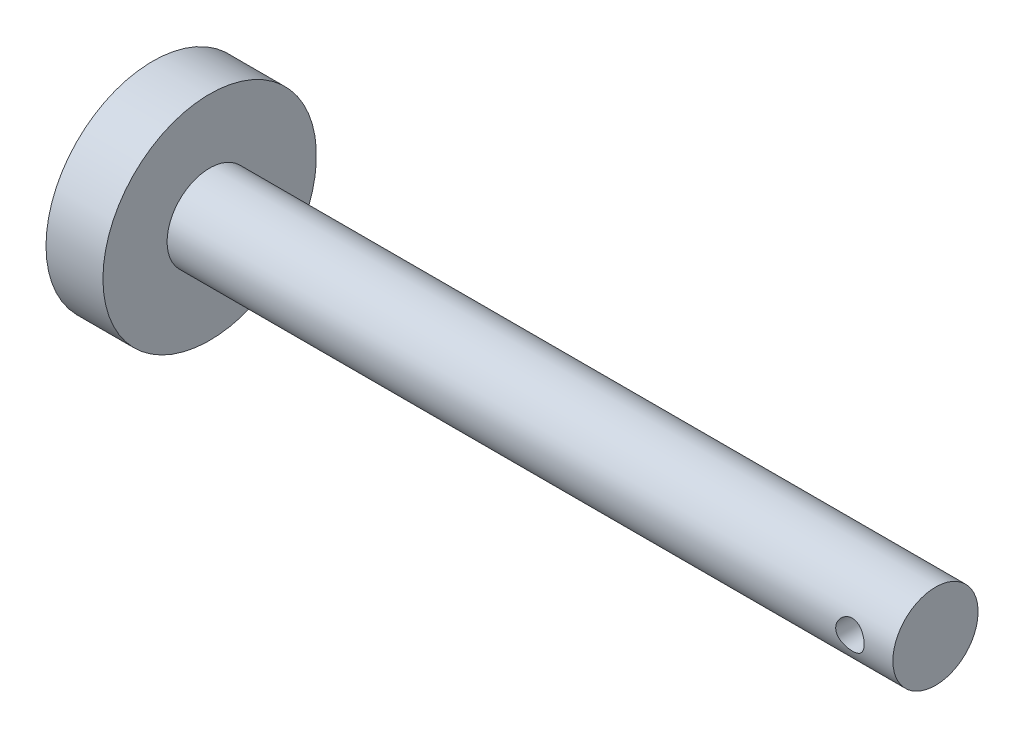
ISO-10303-21;
HEADER;
FILE_DESCRIPTION(('STEP AP214'),'2;1');
FILE_NAME('part.step','',(''),(''),'','','');
FILE_SCHEMA(('AUTOMOTIVE_DESIGN { 1 0 10303 214 1 1 1 1 }'));
ENDSEC;
DATA;
#1=APPLICATION_CONTEXT('core data for automotive mechanical design processes');
#2=APPLICATION_PROTOCOL_DEFINITION('international standard','automotive_design',2000,#1);
#3=PRODUCT_CONTEXT('',#1,'mechanical');
#4=PRODUCT('Part','Part','',(#3));
#5=PRODUCT_RELATED_PRODUCT_CATEGORY('part','',(#4));
#6=PRODUCT_DEFINITION_FORMATION('','',#4);
#7=PRODUCT_DEFINITION_CONTEXT('part definition',#1,'design');
#8=PRODUCT_DEFINITION('design','',#6,#7);
#9=PRODUCT_DEFINITION_SHAPE('','',#8);
#10=(LENGTH_UNIT() NAMED_UNIT(*) SI_UNIT(.MILLI.,.METRE.));
#11=(NAMED_UNIT(*) PLANE_ANGLE_UNIT() SI_UNIT($,.RADIAN.));
#12=(NAMED_UNIT(*) SI_UNIT($,.STERADIAN.) SOLID_ANGLE_UNIT());
#13=UNCERTAINTY_MEASURE_WITH_UNIT(LENGTH_MEASURE(1.E-05),#10,'distance_accuracy_value','');
#14=(GEOMETRIC_REPRESENTATION_CONTEXT(3) GLOBAL_UNCERTAINTY_ASSIGNED_CONTEXT((#13)) GLOBAL_UNIT_ASSIGNED_CONTEXT((#10,
#11,#12)) REPRESENTATION_CONTEXT('',''));
#15=CARTESIAN_POINT('',(0.,0.,0.));
#16=DIRECTION('',(0.,0.,1.));
#17=DIRECTION('',(1.,0.,0.));
#18=AXIS2_PLACEMENT_3D('',#15,#16,#17);
#19=CARTESIAN_POINT('',(-16.06719227637,7.5,0.));
#20=DIRECTION('',(1.,0.,0.));
#21=DIRECTION('',(0.,0.,-1.));
#22=AXIS2_PLACEMENT_3D('',#19,#20,#21);
#23=PLANE('',#22);
#24=CARTESIAN_POINT('',(-16.06719227637,0.,0.));
#25=DIRECTION('',(-1.,0.,0.));
#26=DIRECTION('',(0.,0.,1.));
#27=AXIS2_PLACEMENT_3D('',#24,#25,#26);
#28=CIRCLE('',#27,7.5);
#29=CARTESIAN_POINT('',(-16.06719227637,0.,7.5));
#30=VERTEX_POINT('',#29);
#31=EDGE_CURVE('E95',#30,#30,#28,.T.);
#32=ORIENTED_EDGE('',*,*,#31,.T.);
#33=EDGE_LOOP('',(#32));
#34=FACE_BOUND('',#33,.T.);
#35=ADVANCED_FACE('F37',(#34),#23,.F.);
#36=CARTESIAN_POINT('',(38.93280772363,0.,0.));
#37=DIRECTION('',(-1.,0.,0.));
#38=DIRECTION('',(0.,0.,1.));
#39=AXIS2_PLACEMENT_3D('',#36,#37,#38);
#40=PLANE('',#39);
#41=CARTESIAN_POINT('',(38.93280772363,0.,0.));
#42=DIRECTION('',(-1.,0.,0.));
#43=DIRECTION('',(0.,0.,1.));
#44=AXIS2_PLACEMENT_3D('',#41,#42,#43);
#45=CIRCLE('',#44,2.99222797927462);
#46=CARTESIAN_POINT('',(38.93280772363,0.,2.99222797927462));
#47=VERTEX_POINT('',#46);
#48=EDGE_CURVE('E10',#47,#47,#45,.T.);
#49=ORIENTED_EDGE('',*,*,#48,.F.);
#50=EDGE_LOOP('',(#49));
#51=FACE_BOUND('',#50,.T.);
#52=ADVANCED_FACE('F83',(#51),#40,.F.);
#53=CARTESIAN_POINT('',(-16.06719227637,0.,0.));
#54=DIRECTION('',(-1.,0.,0.));
#55=DIRECTION('',(0.,0.,1.));
#56=AXIS2_PLACEMENT_3D('',#53,#54,#55);
#57=CYLINDRICAL_SURFACE('',#56,2.99222797927462);
#58=CARTESIAN_POINT('',(36.9118895102414,0.,2.99222797927462));
#59=CARTESIAN_POINT('',(36.9118897922976,-0.0545553253540949,2.99222815282481));
#60=CARTESIAN_POINT('',(36.9074105730416,-0.109108891827844,2.99072223037483));
#61=CARTESIAN_POINT('',(36.8896672231851,-0.216608687992767,2.98486319522237));
#62=CARTESIAN_POINT('',(36.8764022257693,-0.269554758547358,2.9805098015855));
#63=CARTESIAN_POINT('',(36.8415931344329,-0.372274239578402,2.96942874053509));
#64=CARTESIAN_POINT('',(36.8200629233711,-0.422052807852353,2.96270505597474));
#65=CARTESIAN_POINT('',(36.7693974722776,-0.517292326825729,2.94756937414283));
#66=CARTESIAN_POINT('',(36.7402607198645,-0.562752416443161,2.93915704120028));
#67=CARTESIAN_POINT('',(36.6741447482866,-0.649646175439101,2.92120171610127));
#68=CARTESIAN_POINT('',(36.6369482371645,-0.690908860879529,2.91163153890286));
#69=CARTESIAN_POINT('',(36.5562306004885,-0.766741351328753,2.89258838974004));
#70=CARTESIAN_POINT('',(36.5127080761975,-0.801309672201839,2.88311543977066));
#71=CARTESIAN_POINT('',(36.4190319345908,-0.863750369743544,2.86503984738372));
#72=CARTESIAN_POINT('',(36.3687229051216,-0.891400099725266,2.85647031150325));
#73=CARTESIAN_POINT('',(36.2638362080172,-0.937773146111818,2.84158535325049));
#74=CARTESIAN_POINT('',(36.2092598567621,-0.956499202737065,2.83526923906284));
#75=CARTESIAN_POINT('',(36.099332546151,-0.983851233319363,2.82589260335001));
#76=CARTESIAN_POINT('',(36.0440703819927,-0.99279771718112,2.8227290919144));
#77=CARTESIAN_POINT('',(35.9327457559515,-1.00133859761036,2.81971129116668));
#78=CARTESIAN_POINT('',(35.8766835483164,-1.00093590192539,2.81985597295223));
#79=CARTESIAN_POINT('',(35.7680875809307,-0.991038635936562,2.82334798587778));
#80=CARTESIAN_POINT('',(35.7155100865583,-0.981962843021346,2.8265477950195));
#81=CARTESIAN_POINT('',(35.612671995397,-0.955660359448898,2.83554805825484));
#82=CARTESIAN_POINT('',(35.5624116781565,-0.938432688143691,2.84134882523195));
#83=CARTESIAN_POINT('',(35.4646851487417,-0.896042234125146,2.85500219226893));
#84=CARTESIAN_POINT('',(35.4172772385225,-0.870755678941096,2.86288644521403));
#85=CARTESIAN_POINT('',(35.3272453444493,-0.813051181448322,2.87980522122608));
#86=CARTESIAN_POINT('',(35.2846227535946,-0.780631170688277,2.88884007760685));
#87=CARTESIAN_POINT('',(35.2030188937312,-0.707570657994943,2.9076219339705));
#88=CARTESIAN_POINT('',(35.1643462468633,-0.666587953223343,2.9173814199205));
#89=CARTESIAN_POINT('',(35.0943418664469,-0.578598961384775,2.93609811511371));
#90=CARTESIAN_POINT('',(35.0630108442934,-0.531592091265331,2.9450552465578));
#91=CARTESIAN_POINT('',(35.0083288722668,-0.432231946625073,2.96127665436627));
#92=CARTESIAN_POINT('',(34.9850610058379,-0.379829832167567,2.96852307392317));
#93=CARTESIAN_POINT('',(34.947766481642,-0.27155507842802,2.9803768935242));
#94=CARTESIAN_POINT('',(34.9337365963177,-0.215683658722359,2.98498521519101));
#95=CARTESIAN_POINT('',(34.9158639668068,-0.104668687219116,2.99089074836865));
#96=CARTESIAN_POINT('',(34.9116042188026,-0.0495993855401659,2.99232340654313));
#97=CARTESIAN_POINT('',(34.9122043898332,0.0604783617813329,2.99212266375025));
#98=CARTESIAN_POINT('',(34.9170627604519,0.115486816169566,2.99048978336498));
#99=CARTESIAN_POINT('',(34.935431529317,0.222209758892014,2.98443083770046));
#100=CARTESIAN_POINT('',(34.9486856314807,0.273973524036717,2.98008756871714));
#101=CARTESIAN_POINT('',(34.9831488550097,0.374521565064081,2.96912811405464));
#102=CARTESIAN_POINT('',(35.0043589918167,0.423305459696415,2.96251163825145));
#103=CARTESIAN_POINT('',(35.0547522825543,0.517943560918759,2.94746002478722));
#104=CARTESIAN_POINT('',(35.0841309973122,0.563686539141972,2.93898151679125));
#105=CARTESIAN_POINT('',(35.1497979137928,0.64972873634673,2.92116664610883));
#106=CARTESIAN_POINT('',(35.1860882354266,0.690026278617786,2.91183002067853));
#107=CARTESIAN_POINT('',(35.2665090247253,0.765949890103637,2.89281034193806));
#108=CARTESIAN_POINT('',(35.3109219312623,0.801278429858598,2.88313094917177));
#109=CARTESIAN_POINT('',(35.4052531694908,0.864018407642213,2.86495565099535));
#110=CARTESIAN_POINT('',(35.4551715537779,0.891429770026693,2.85645975689327));
#111=CARTESIAN_POINT('',(35.5591245708845,0.937432570091034,2.84169570333779));
#112=CARTESIAN_POINT('',(35.6131510266381,0.956041022681105,2.83542325218495));
#113=CARTESIAN_POINT('',(35.7238289773025,0.98381121924061,2.82590931343305));
#114=CARTESIAN_POINT('',(35.7804792692873,0.992977248259338,2.82266645104403));
#115=CARTESIAN_POINT('',(35.8916496186296,1.00126717836944,2.8197357369249));
#116=CARTESIAN_POINT('',(35.9461286278682,1.0008851745644,2.81987296540262));
#117=CARTESIAN_POINT('',(36.054202942642,0.991306883732841,2.82325417688932));
#118=CARTESIAN_POINT('',(36.107798301099,0.982111126527755,2.82649797315307));
#119=CARTESIAN_POINT('',(36.2115599846486,0.955516856602325,2.83559626169983));
#120=CARTESIAN_POINT('',(36.2617723793747,0.938279161739362,2.84139945359746));
#121=CARTESIAN_POINT('',(36.3586306012773,0.896220842829922,2.85494348321333));
#122=CARTESIAN_POINT('',(36.4052756313084,0.871398530116835,2.86268475236265));
#123=CARTESIAN_POINT('',(36.4958907779495,0.813606432432029,2.87965560987436));
#124=CARTESIAN_POINT('',(36.5396540958561,0.780327274214489,2.88893555364213));
#125=CARTESIAN_POINT('',(36.6211346205836,0.707088294365825,2.90772797334199));
#126=CARTESIAN_POINT('',(36.6588501078308,0.667126579264388,2.91724051452536));
#127=CARTESIAN_POINT('',(36.7286568626194,0.579773348371367,2.93587458592907));
#128=CARTESIAN_POINT('',(36.7604692448884,0.532151760630108,2.94496611011908));
#129=CARTESIAN_POINT('',(36.8156032277249,0.431937269836589,2.96132252694286));
#130=CARTESIAN_POINT('',(36.8389269471947,0.37934561152568,2.96858787527825));
#131=CARTESIAN_POINT('',(36.8754722506828,0.273005105452466,2.9802067304013));
#132=CARTESIAN_POINT('',(36.8890848061381,0.219403052061928,2.98467192946266));
#133=CARTESIAN_POINT('',(36.907292031277,0.1105330837406,2.99068205739454));
#134=CARTESIAN_POINT('',(36.9118892245127,0.0552656393803016,2.99222780346478));
#135=CARTESIAN_POINT('',(36.9118895102414,0.,2.99222797927462));
#136=B_SPLINE_CURVE_WITH_KNOTS('',3,(#58,#59,#60,#61,#62,#63,#64,#65,#66,#67,#68,#69,#70,#71,
#72,#73,#74,#75,#76,#77,#78,#79,#80,#81,#82,#83,#84,#85,#86,#87,#88,#89,#90,#91,#92,#93,#94,#95,
#96,#97,#98,#99,#100,#101,#102,#103,#104,#105,#106,#107,#108,#109,#110,#111,#112,#113,#114,#115,
#116,#117,#118,#119,#120,#121,#122,#123,#124,#125,#126,#127,#128,#129,#130,#131,#132,#133,#134,
#135),.UNSPECIFIED.,.T.,.F.,(4,2,2,2,2,2,2,2,2,2,2,2,2,2,2,2,2,2,2,2,2,2,2,2,2,2,2,2,2,2,2,2,2,
2,2,2,2,2,4),(0.,0.163462592636157,0.326941315090178,0.490146639723511,0.653384438634844,
0.821741557494387,0.990135958380953,1.16340203332038,1.33661486856226,1.50396290308571,
1.67125889033436,1.8308647773272,1.99048986934111,2.15269536824717,2.3149479631735,
2.48571830413902,2.65650518571507,2.82900290488576,3.00144032493761,3.16636880822431,
3.33126928630178,3.49136363130494,3.65147841636641,3.8158168627328,3.98020579599631,
4.15210498405008,4.32400581444953,4.49557301082296,4.66706231425042,4.82969661573378,
4.99232114138932,5.15182451111687,5.31136341915667,5.47789371291847,5.64447127243779,
5.81758761399213,5.99066071333023,6.15629797126751,6.32188885791632),.UNSPECIFIED.);
#137=CARTESIAN_POINT('',(36.9118895102414,0.,2.99222797927462));
#138=VERTEX_POINT('',#137);
#139=EDGE_CURVE('E40',#138,#138,#136,.T.);
#140=ORIENTED_EDGE('',*,*,#139,.T.);
#141=EDGE_LOOP('',(#140));
#142=FACE_BOUND('',#141,.T.);
#143=CARTESIAN_POINT('',(36.9118895102413,0.,-2.99222797927462));
#144=CARTESIAN_POINT('',(36.9118897922976,0.0545553253540957,-2.99222815282481));
#145=CARTESIAN_POINT('',(36.9074105730416,0.109108891827846,-2.99072223037483));
#146=CARTESIAN_POINT('',(36.8896672231851,0.216608687992768,-2.98486319522237));
#147=CARTESIAN_POINT('',(36.8764022257693,0.269554758547358,-2.9805098015855));
#148=CARTESIAN_POINT('',(36.8415931344329,0.372274239578399,-2.96942874053509));
#149=CARTESIAN_POINT('',(36.8200629233711,0.42205280785235,-2.96270505597474));
#150=CARTESIAN_POINT('',(36.7693974722776,0.517292326825725,-2.94756937414283));
#151=CARTESIAN_POINT('',(36.7402607198645,0.562752416443158,-2.93915704120028));
#152=CARTESIAN_POINT('',(36.6741447482866,0.649646175439101,-2.92120171610127));
#153=CARTESIAN_POINT('',(36.6369482371645,0.690908860879529,-2.91163153890286));
#154=CARTESIAN_POINT('',(36.5562306004885,0.766741351328753,-2.89258838974004));
#155=CARTESIAN_POINT('',(36.5127080761975,0.801309672201839,-2.88311543977066));
#156=CARTESIAN_POINT('',(36.4190319345908,0.863750369743544,-2.86503984738372));
#157=CARTESIAN_POINT('',(36.3687229051216,0.891400099725266,-2.85647031150325));
#158=CARTESIAN_POINT('',(36.2638362080172,0.937773146111818,-2.84158535325049));
#159=CARTESIAN_POINT('',(36.2092598567621,0.956499202737065,-2.83526923906284));
#160=CARTESIAN_POINT('',(36.099332546151,0.983851233319363,-2.82589260335001));
#161=CARTESIAN_POINT('',(36.0440703819927,0.99279771718112,-2.8227290919144));
#162=CARTESIAN_POINT('',(35.9327457559515,1.00133859761036,-2.81971129116668));
#163=CARTESIAN_POINT('',(35.8766835483164,1.00093590192539,-2.81985597295223));
#164=CARTESIAN_POINT('',(35.7680875809307,0.991038635936562,-2.82334798587778));
#165=CARTESIAN_POINT('',(35.7155100865583,0.981962843021346,-2.8265477950195));
#166=CARTESIAN_POINT('',(35.612671995397,0.955660359448898,-2.83554805825484));
#167=CARTESIAN_POINT('',(35.5624116781565,0.938432688143691,-2.84134882523195));
#168=CARTESIAN_POINT('',(35.4646851487417,0.896042234125146,-2.85500219226893));
#169=CARTESIAN_POINT('',(35.4172772385225,0.870755678941096,-2.86288644521403));
#170=CARTESIAN_POINT('',(35.3272453444493,0.813051181448322,-2.87980522122608));
#171=CARTESIAN_POINT('',(35.2846227535946,0.780631170688277,-2.88884007760685));
#172=CARTESIAN_POINT('',(35.2030188937312,0.707570657994943,-2.9076219339705));
#173=CARTESIAN_POINT('',(35.1643462468633,0.666587953223343,-2.9173814199205));
#174=CARTESIAN_POINT('',(35.0943418664469,0.578598961384775,-2.93609811511371));
#175=CARTESIAN_POINT('',(35.0630108442934,0.531592091265331,-2.9450552465578));
#176=CARTESIAN_POINT('',(35.0083288722668,0.432231946625073,-2.96127665436627));
#177=CARTESIAN_POINT('',(34.9850610058379,0.379829832167566,-2.96852307392317));
#178=CARTESIAN_POINT('',(34.947766481642,0.271555078428019,-2.9803768935242));
#179=CARTESIAN_POINT('',(34.9337365963177,0.215683658722358,-2.98498521519101));
#180=CARTESIAN_POINT('',(34.9158639668068,0.104668687219115,-2.99089074836865));
#181=CARTESIAN_POINT('',(34.9116042188026,0.0495993855401653,-2.99232340654313));
#182=CARTESIAN_POINT('',(34.9122043898332,-0.0604783617813333,-2.99212266375025));
#183=CARTESIAN_POINT('',(34.9170627604519,-0.115486816169567,-2.99048978336498));
#184=CARTESIAN_POINT('',(34.935431529317,-0.222209758892015,-2.98443083770046));
#185=CARTESIAN_POINT('',(34.9486856314807,-0.273973524036717,-2.98008756871714));
#186=CARTESIAN_POINT('',(34.9831488550097,-0.374521565064081,-2.96912811405464));
#187=CARTESIAN_POINT('',(35.0043589918167,-0.423305459696414,-2.96251163825145));
#188=CARTESIAN_POINT('',(35.0547522825543,-0.517943560918758,-2.94746002478722));
#189=CARTESIAN_POINT('',(35.0841309973122,-0.563686539141971,-2.93898151679125));
#190=CARTESIAN_POINT('',(35.1497979137928,-0.649728736346729,-2.92116664610883));
#191=CARTESIAN_POINT('',(35.1860882354266,-0.690026278617785,-2.91183002067853));
#192=CARTESIAN_POINT('',(35.2665090247253,-0.765949890103635,-2.89281034193806));
#193=CARTESIAN_POINT('',(35.3109219312623,-0.801278429858597,-2.88313094917177));
#194=CARTESIAN_POINT('',(35.4052531694908,-0.864018407642213,-2.86495565099535));
#195=CARTESIAN_POINT('',(35.4551715537779,-0.891429770026693,-2.85645975689327));
#196=CARTESIAN_POINT('',(35.5591245708845,-0.937432570091034,-2.84169570333779));
#197=CARTESIAN_POINT('',(35.6131510266381,-0.956041022681105,-2.83542325218495));
#198=CARTESIAN_POINT('',(35.7238289773025,-0.98381121924061,-2.82590931343305));
#199=CARTESIAN_POINT('',(35.7804792692873,-0.992977248259338,-2.82266645104403));
#200=CARTESIAN_POINT('',(35.8916496186296,-1.00126717836944,-2.8197357369249));
#201=CARTESIAN_POINT('',(35.9461286278682,-1.0008851745644,-2.81987296540262));
#202=CARTESIAN_POINT('',(36.054202942642,-0.991306883732841,-2.82325417688932));
#203=CARTESIAN_POINT('',(36.107798301099,-0.982111126527755,-2.82649797315307));
#204=CARTESIAN_POINT('',(36.2115599846486,-0.955516856602325,-2.83559626169983));
#205=CARTESIAN_POINT('',(36.2617723793747,-0.938279161739362,-2.84139945359746));
#206=CARTESIAN_POINT('',(36.3586306012773,-0.896220842829922,-2.85494348321333));
#207=CARTESIAN_POINT('',(36.4052756313084,-0.871398530116835,-2.86268475236265));
#208=CARTESIAN_POINT('',(36.4958907779495,-0.813606432432028,-2.87965560987436));
#209=CARTESIAN_POINT('',(36.5396540958561,-0.780327274214488,-2.88893555364213));
#210=CARTESIAN_POINT('',(36.6211346205836,-0.707088294365825,-2.90772797334199));
#211=CARTESIAN_POINT('',(36.6588501078308,-0.667126579264388,-2.91724051452536));
#212=CARTESIAN_POINT('',(36.7286568626194,-0.579773348371366,-2.93587458592907));
#213=CARTESIAN_POINT('',(36.7604692448884,-0.532151760630106,-2.94496611011908));
#214=CARTESIAN_POINT('',(36.8156032277249,-0.431937269836586,-2.96132252694286));
#215=CARTESIAN_POINT('',(36.8389269471947,-0.379345611525678,-2.96858787527825));
#216=CARTESIAN_POINT('',(36.8754722506828,-0.273005105452466,-2.9802067304013));
#217=CARTESIAN_POINT('',(36.8890848061381,-0.219403052061929,-2.98467192946266));
#218=CARTESIAN_POINT('',(36.907292031277,-0.110533083740602,-2.99068205739454));
#219=CARTESIAN_POINT('',(36.9118892245127,-0.0552656393803023,-2.99222780346478));
#220=CARTESIAN_POINT('',(36.9118895102413,0.,-2.99222797927462));
#221=B_SPLINE_CURVE_WITH_KNOTS('',3,(#143,#144,#145,#146,#147,#148,#149,#150,#151,#152,#153,
#154,#155,#156,#157,#158,#159,#160,#161,#162,#163,#164,#165,#166,#167,#168,#169,#170,#171,#172,
#173,#174,#175,#176,#177,#178,#179,#180,#181,#182,#183,#184,#185,#186,#187,#188,#189,#190,#191,
#192,#193,#194,#195,#196,#197,#198,#199,#200,#201,#202,#203,#204,#205,#206,#207,#208,#209,#210,
#211,#212,#213,#214,#215,#216,#217,#218,#219,#220),.UNSPECIFIED.,.T.,.F.,(4,2,2,2,2,2,2,2,2,2,2,
2,2,2,2,2,2,2,2,2,2,2,2,2,2,2,2,2,2,2,2,2,2,2,2,2,2,2,4),(0.,0.163462592636158,
0.326941315090177,0.490146639723502,0.653384438634843,0.821741557494386,0.990135958380952,
1.16340203332038,1.33661486856226,1.50396290308571,1.67125889033436,1.8308647773272,
1.99048986934111,2.15269536824717,2.3149479631735,2.48571830413902,2.65650518571507,
2.82900290488576,3.00144032493761,3.1663688082243,3.33126928630178,3.49136363130493,
3.65147841636641,3.8158168627328,3.98020579599631,4.15210498405007,4.32400581444953,
4.49557301082296,4.66706231425042,4.82969661573378,4.99232114138932,5.15182451111687,
5.31136341915667,5.47789371291847,5.64447127243779,5.81758761399213,5.99066071333022,
6.15629797126751,6.32188885791632),.UNSPECIFIED.);
#222=CARTESIAN_POINT('',(36.9118895102413,0.,-2.99222797927462));
#223=VERTEX_POINT('',#222);
#224=EDGE_CURVE('E59',#223,#223,#221,.T.);
#225=ORIENTED_EDGE('',*,*,#224,.T.);
#226=EDGE_LOOP('',(#225));
#227=FACE_BOUND('',#226,.T.);
#228=CARTESIAN_POINT('',(-12.06719227637,0.,0.));
#229=DIRECTION('',(-1.,0.,0.));
#230=DIRECTION('',(0.,0.,1.));
#231=AXIS2_PLACEMENT_3D('',#228,#229,#230);
#232=CIRCLE('',#231,2.99222797927461);
#233=CARTESIAN_POINT('',(-12.06719227637,0.,2.99222797927461));
#234=VERTEX_POINT('',#233);
#235=EDGE_CURVE('E50',#234,#234,#232,.T.);
#236=ORIENTED_EDGE('',*,*,#235,.F.);
#237=EDGE_LOOP('',(#236));
#238=FACE_BOUND('',#237,.T.);
#239=ORIENTED_EDGE('',*,*,#48,.T.);
#240=EDGE_LOOP('',(#239));
#241=FACE_BOUND('',#240,.T.);
#242=ADVANCED_FACE('F65',(#142,#227,#238,#241),#57,.T.);
#243=CARTESIAN_POINT('',(-12.06719227637,2.99222797927461,0.));
#244=DIRECTION('',(-1.,0.,0.));
#245=DIRECTION('',(0.,0.,1.));
#246=AXIS2_PLACEMENT_3D('',#243,#244,#245);
#247=PLANE('',#246);
#248=CARTESIAN_POINT('',(-12.06719227637,0.,0.));
#249=DIRECTION('',(-1.,0.,0.));
#250=DIRECTION('',(0.,0.,1.));
#251=AXIS2_PLACEMENT_3D('',#248,#249,#250);
#252=CIRCLE('',#251,7.5);
#253=CARTESIAN_POINT('',(-12.06719227637,0.,7.5));
#254=VERTEX_POINT('',#253);
#255=EDGE_CURVE('E56',#254,#254,#252,.T.);
#256=ORIENTED_EDGE('',*,*,#255,.F.);
#257=EDGE_LOOP('',(#256));
#258=FACE_BOUND('',#257,.T.);
#259=ORIENTED_EDGE('',*,*,#235,.T.);
#260=EDGE_LOOP('',(#259));
#261=FACE_BOUND('',#260,.T.);
#262=ADVANCED_FACE('F76',(#258,#261),#247,.F.);
#263=CARTESIAN_POINT('',(-16.06719227637,0.,0.));
#264=DIRECTION('',(-1.,0.,0.));
#265=DIRECTION('',(0.,0.,1.));
#266=AXIS2_PLACEMENT_3D('',#263,#264,#265);
#267=CYLINDRICAL_SURFACE('',#266,7.5);
#268=ORIENTED_EDGE('',*,*,#31,.F.);
#269=EDGE_LOOP('',(#268));
#270=FACE_BOUND('',#269,.T.);
#271=ORIENTED_EDGE('',*,*,#255,.T.);
#272=EDGE_LOOP('',(#271));
#273=FACE_BOUND('',#272,.T.);
#274=ADVANCED_FACE('F72',(#270,#273),#267,.T.);
#275=CARTESIAN_POINT('',(35.9118895102413,0.,-7.5));
#276=DIRECTION('',(0.,0.,1.));
#277=DIRECTION('',(1.,0.,0.));
#278=AXIS2_PLACEMENT_3D('',#275,#276,#277);
#279=CYLINDRICAL_SURFACE('',#278,0.999999999999998);
#280=ORIENTED_EDGE('',*,*,#224,.F.);
#281=EDGE_LOOP('',(#280));
#282=FACE_BOUND('',#281,.T.);
#283=ORIENTED_EDGE('',*,*,#139,.F.);
#284=EDGE_LOOP('',(#283));
#285=FACE_BOUND('',#284,.T.);
#286=ADVANCED_FACE('F68',(#282,#285),#279,.F.);
#287=CLOSED_SHELL('',(#35,#52,#242,#262,#274,#286));
#288=MANIFOLD_SOLID_BREP('B2',#287);
#289=ADVANCED_BREP_SHAPE_REPRESENTATION('',(#18,#288),#14);
#290=SHAPE_DEFINITION_REPRESENTATION(#9,#289);
ENDSEC;
END-ISO-10303-21;
